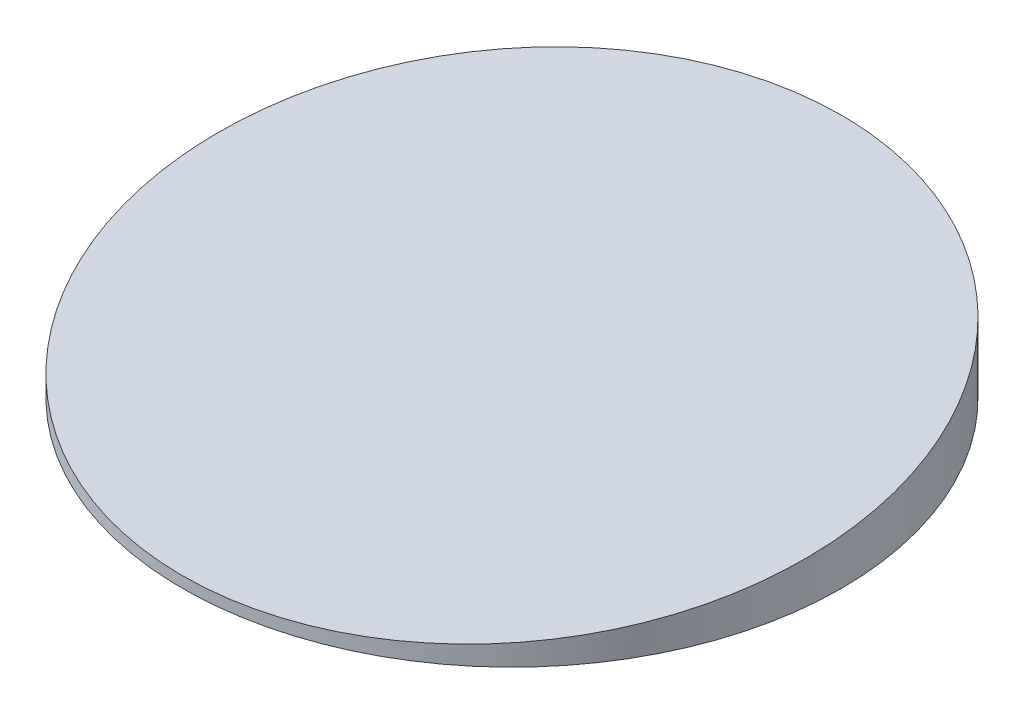
ISO-10303-21;
HEADER;
FILE_DESCRIPTION(('STEP AP214'),'2;1');
FILE_NAME('part.step','',(''),(''),'','','');
FILE_SCHEMA(('AUTOMOTIVE_DESIGN { 1 0 10303 214 1 1 1 1 }'));
ENDSEC;
DATA;
#1=APPLICATION_CONTEXT('core data for automotive mechanical design processes');
#2=APPLICATION_PROTOCOL_DEFINITION('international standard','automotive_design',2000,#1);
#3=PRODUCT_CONTEXT('',#1,'mechanical');
#4=PRODUCT('Part','Part','',(#3));
#5=PRODUCT_RELATED_PRODUCT_CATEGORY('part','',(#4));
#6=PRODUCT_DEFINITION_FORMATION('','',#4);
#7=PRODUCT_DEFINITION_CONTEXT('part definition',#1,'design');
#8=PRODUCT_DEFINITION('design','',#6,#7);
#9=PRODUCT_DEFINITION_SHAPE('','',#8);
#10=(LENGTH_UNIT() NAMED_UNIT(*) SI_UNIT(.MILLI.,.METRE.));
#11=(NAMED_UNIT(*) PLANE_ANGLE_UNIT() SI_UNIT($,.RADIAN.));
#12=(NAMED_UNIT(*) SI_UNIT($,.STERADIAN.) SOLID_ANGLE_UNIT());
#13=UNCERTAINTY_MEASURE_WITH_UNIT(LENGTH_MEASURE(1.E-05),#10,'distance_accuracy_value','');
#14=(GEOMETRIC_REPRESENTATION_CONTEXT(3) GLOBAL_UNCERTAINTY_ASSIGNED_CONTEXT((#13)) GLOBAL_UNIT_ASSIGNED_CONTEXT((#10,
#11,#12)) REPRESENTATION_CONTEXT('',''));
#15=CARTESIAN_POINT('',(0.,0.,0.));
#16=DIRECTION('',(0.,0.,1.));
#17=DIRECTION('',(1.,0.,0.));
#18=AXIS2_PLACEMENT_3D('',#15,#16,#17);
#19=CARTESIAN_POINT('',(-132.804,5377.90686113686,-699.260009999996));
#20=DIRECTION('',(0.,0.994521895368274,0.104528463267651));
#21=DIRECTION('',(0.,-0.104528463267651,0.994521895368274));
#22=AXIS2_PLACEMENT_3D('',#19,#20,#21);
#23=PLANE('',#22);
#24=CARTESIAN_POINT('',(-7.41369359066237E-13,5377.90686113686,-699.260009999996));
#25=DIRECTION('',(0.,0.994521895368274,0.104528463267651));
#26=DIRECTION('',(-8.03360702983876E-13,0.104528463267651,-0.994521895368274));
#27=AXIS2_PLACEMENT_3D('',#24,#25,#26);
#28=ELLIPSE('',#27,65.3580381716282,65.);
#29=CARTESIAN_POINT('',(-5.32474488502724E-11,5384.73863642913,-764.260009999995));
#30=VERTEX_POINT('',#29);
#31=EDGE_CURVE('E19',#30,#30,#28,.F.);
#32=ORIENTED_EDGE('',*,*,#31,.F.);
#33=EDGE_LOOP('',(#32));
#34=FACE_BOUND('',#33,.T.);
#35=ADVANCED_FACE('F15',(#34),#23,.T.);
#36=CARTESIAN_POINT('',(0.,5368.90686113685,-699.260009999996));
#37=DIRECTION('',(0.,1.,0.));
#38=DIRECTION('',(-1.,0.,0.));
#39=AXIS2_PLACEMENT_3D('',#36,#37,#38);
#40=CYLINDRICAL_SURFACE('',#39,65.);
#41=ORIENTED_EDGE('',*,*,#31,.T.);
#42=EDGE_LOOP('',(#41));
#43=FACE_BOUND('',#42,.T.);
#44=CARTESIAN_POINT('',(-7.81597009337388E-13,5368.90686113687,-699.260009999996));
#45=DIRECTION('',(0.,1.,0.));
#46=DIRECTION('',(-1.,0.,0.));
#47=AXIS2_PLACEMENT_3D('',#44,#45,#46);
#48=CIRCLE('',#47,65.0000000000001);
#49=CARTESIAN_POINT('',(-65.0000000000009,5368.90686113686,-699.260009999996));
#50=VERTEX_POINT('',#49);
#51=EDGE_CURVE('E10',#50,#50,#48,.F.);
#52=ORIENTED_EDGE('',*,*,#51,.F.);
#53=EDGE_LOOP('',(#52));
#54=FACE_BOUND('',#53,.T.);
#55=ADVANCED_FACE('F28',(#43,#54),#40,.T.);
#56=CARTESIAN_POINT('',(0.,5368.90686113686,-566.456009999996));
#57=DIRECTION('',(0.,-1.,0.));
#58=DIRECTION('',(0.,0.,-1.));
#59=AXIS2_PLACEMENT_3D('',#56,#57,#58);
#60=PLANE('',#59);
#61=ORIENTED_EDGE('',*,*,#51,.T.);
#62=EDGE_LOOP('',(#61));
#63=FACE_BOUND('',#62,.T.);
#64=ADVANCED_FACE('F17',(#63),#60,.T.);
#65=CLOSED_SHELL('',(#35,#55,#64));
#66=MANIFOLD_SOLID_BREP('B1',#65);
#67=ADVANCED_BREP_SHAPE_REPRESENTATION('',(#18,#66),#14);
#68=SHAPE_DEFINITION_REPRESENTATION(#9,#67);
ENDSEC;
END-ISO-10303-21;
